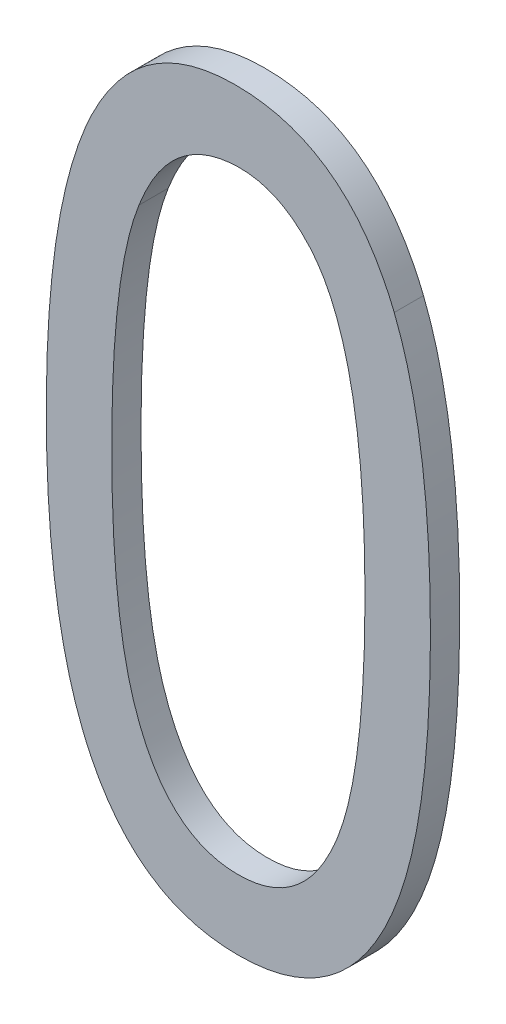
ISO-10303-21;
HEADER;
FILE_DESCRIPTION(('STEP AP214'),'2;1');
FILE_NAME('part.step','',(''),(''),'','','');
FILE_SCHEMA(('AUTOMOTIVE_DESIGN { 1 0 10303 214 1 1 1 1 }'));
ENDSEC;
DATA;
#1=APPLICATION_CONTEXT('core data for automotive mechanical design processes');
#2=APPLICATION_PROTOCOL_DEFINITION('international standard','automotive_design',2000,#1);
#3=PRODUCT_CONTEXT('',#1,'mechanical');
#4=PRODUCT('Part','Part','',(#3));
#5=PRODUCT_RELATED_PRODUCT_CATEGORY('part','',(#4));
#6=PRODUCT_DEFINITION_FORMATION('','',#4);
#7=PRODUCT_DEFINITION_CONTEXT('part definition',#1,'design');
#8=PRODUCT_DEFINITION('design','',#6,#7);
#9=PRODUCT_DEFINITION_SHAPE('','',#8);
#10=(LENGTH_UNIT() NAMED_UNIT(*) SI_UNIT(.MILLI.,.METRE.));
#11=(NAMED_UNIT(*) PLANE_ANGLE_UNIT() SI_UNIT($,.RADIAN.));
#12=(NAMED_UNIT(*) SI_UNIT($,.STERADIAN.) SOLID_ANGLE_UNIT());
#13=UNCERTAINTY_MEASURE_WITH_UNIT(LENGTH_MEASURE(1.E-05),#10,'distance_accuracy_value','');
#14=(GEOMETRIC_REPRESENTATION_CONTEXT(3) GLOBAL_UNCERTAINTY_ASSIGNED_CONTEXT((#13)) GLOBAL_UNIT_ASSIGNED_CONTEXT((#10,
#11,#12)) REPRESENTATION_CONTEXT('',''));
#15=CARTESIAN_POINT('',(0.,0.,0.));
#16=DIRECTION('',(0.,0.,1.));
#17=DIRECTION('',(1.,0.,0.));
#18=AXIS2_PLACEMENT_3D('',#15,#16,#17);
#19=CARTESIAN_POINT('',(166.747554665936,127.21231620352,-39.));
#20=DIRECTION('',(0.,0.,-1.));
#21=DIRECTION('',(-1.,0.,0.));
#22=AXIS2_PLACEMENT_3D('',#19,#20,#21);
#23=PLANE('',#22);
#24=CARTESIAN_POINT('',(166.853987644932,126.928948416499,-39.));
#25=CARTESIAN_POINT('',(166.847814878892,126.9132536326,-39.));
#26=CARTESIAN_POINT('',(166.84221538166,126.897351026162,-39.));
#27=CARTESIAN_POINT('',(166.831968031697,126.865261709913,-39.));
#28=CARTESIAN_POINT('',(166.827318998028,126.849075380124,-39.));
#29=CARTESIAN_POINT('',(166.814530243621,126.800398594227,-39.));
#30=CARTESIAN_POINT('',(166.807488482466,126.767623621181,-39.));
#31=CARTESIAN_POINT('',(166.795445926564,126.701804748235,-39.));
#32=CARTESIAN_POINT('',(166.79044024456,126.668761688815,-39.));
#33=CARTESIAN_POINT('',(166.781914374771,126.602483406797,-39.));
#34=CARTESIAN_POINT('',(166.778394422721,126.569248154551,-39.));
#35=CARTESIAN_POINT('',(166.77248473704,126.502527179504,-39.));
#36=CARTESIAN_POINT('',(166.77010027084,126.469041007509,-39.));
#37=CARTESIAN_POINT('',(166.766249983077,126.402020945451,-39.));
#38=CARTESIAN_POINT('',(166.764784069523,126.368487060503,-39.));
#39=CARTESIAN_POINT('',(166.761985691489,126.282333840904,-39.));
#40=CARTESIAN_POINT('',(166.761202394598,126.229697348206,-39.));
#41=CARTESIAN_POINT('',(166.761002877374,126.124407380513,-39.));
#42=CARTESIAN_POINT('',(166.76158707745,126.071753905272,-39.));
#43=CARTESIAN_POINT('',(166.764474046605,125.966678071929,-39.));
#44=CARTESIAN_POINT('',(166.766770635641,125.914255562963,-39.));
#45=CARTESIAN_POINT('',(166.773707927429,125.809581309508,-39.));
#46=CARTESIAN_POINT('',(166.778347255698,125.75732948295,-39.));
#47=CARTESIAN_POINT('',(166.789044230652,125.670096848503,-39.));
#48=CARTESIAN_POINT('',(166.794155220586,125.635005806206,-39.));
#49=CARTESIAN_POINT('',(166.803529058764,125.582601834785,-39.));
#50=CARTESIAN_POINT('',(166.806946663373,125.565138416613,-39.));
#51=CARTESIAN_POINT('',(166.814482109437,125.530363641215,-39.));
#52=CARTESIAN_POINT('',(166.818599822044,125.513052256623,-39.));
#53=CARTESIAN_POINT('',(166.825981524059,125.485179486085,-39.));
#54=CARTESIAN_POINT('',(166.828977264472,125.474547424449,-39.));
#55=CARTESIAN_POINT('',(166.835369162163,125.453407013795,-39.));
#56=CARTESIAN_POINT('',(166.838765253605,125.442898644748,-39.));
#57=CARTESIAN_POINT('',(166.849486378761,125.411529648947,-39.));
#58=CARTESIAN_POINT('',(166.85733910185,125.390844351044,-39.));
#59=CARTESIAN_POINT('',(166.874764494375,125.350333566176,-39.));
#60=CARTESIAN_POINT('',(166.884327456152,125.330503972339,-39.));
#61=CARTESIAN_POINT('',(166.905591331492,125.292032067889,-39.));
#62=CARTESIAN_POINT('',(166.917288994235,125.273388009324,-39.));
#63=CARTESIAN_POINT('',(166.941170289406,125.240815954733,-39.));
#64=CARTESIAN_POINT('',(166.95297192051,125.226612110534,-39.));
#65=CARTESIAN_POINT('',(166.978558605853,125.200122518192,-39.));
#66=CARTESIAN_POINT('',(166.99234049841,125.187833776388,-39.));
#67=CARTESIAN_POINT('',(167.022017247193,125.165732391389,-39.));
#68=CARTESIAN_POINT('',(167.037932510843,125.155946714029,-39.));
#69=CARTESIAN_POINT('',(167.071347495604,125.139609832535,-39.));
#70=CARTESIAN_POINT('',(167.088846710421,125.133057599154,-39.));
#71=CARTESIAN_POINT('',(167.122842872521,125.123852414056,-39.));
#72=CARTESIAN_POINT('',(167.139250883468,125.120861105097,-39.));
#73=CARTESIAN_POINT('',(167.172350294251,125.117318580688,-39.));
#74=CARTESIAN_POINT('',(167.18904230906,125.116773594918,-39.));
#75=CARTESIAN_POINT('',(167.224577997575,125.118003531979,-39.));
#76=CARTESIAN_POINT('',(167.243413015985,125.120096169284,-39.));
#77=CARTESIAN_POINT('',(167.280348195018,125.127690302764,-39.));
#78=CARTESIAN_POINT('',(167.298450660649,125.133180047794,-39.));
#79=CARTESIAN_POINT('',(167.332291451205,125.147167435494,-39.));
#80=CARTESIAN_POINT('',(167.34810497003,125.155483745995,-39.));
#81=CARTESIAN_POINT('',(167.378033398099,125.174769768659,-39.));
#82=CARTESIAN_POINT('',(167.392145682045,125.185743505126,-39.));
#83=CARTESIAN_POINT('',(167.422420626719,125.213297000385,-39.));
#84=CARTESIAN_POINT('',(167.437942208866,125.230573008783,-39.));
#85=CARTESIAN_POINT('',(167.466131814948,125.267355855729,-39.));
#86=CARTESIAN_POINT('',(167.478787817926,125.286871592627,-39.));
#87=CARTESIAN_POINT('',(167.498658309246,125.321875723024,-39.));
#88=CARTESIAN_POINT('',(167.506425874882,125.337060091012,-39.));
#89=CARTESIAN_POINT('',(167.520780695096,125.367792273056,-39.));
#90=CARTESIAN_POINT('',(167.527379137551,125.383334828578,-39.));
#91=CARTESIAN_POINT('',(167.533528222996,125.399038411206,-39.));
#92=B_SPLINE_CURVE_WITH_KNOTS('',3,(#24,#25,#26,#27,#28,#29,#30,#31,#32,#33,#34,#35,#36,#37,#38,
#39,#40,#41,#42,#43,#44,#45,#46,#47,#48,#49,#50,#51,#52,#53,#54,#55,#56,#57,#58,#59,#60,#61,#62,
#63,#64,#65,#66,#67,#68,#69,#70,#71,#72,#73,#74,#75,#76,#77,#78,#79,#80,#81,#82,#83,#84,#85,#86,
#87,#88,#89,#90,#91),.UNSPECIFIED.,.F.,.F.,(4,2,2,2,2,2,2,2,2,2,2,2,2,2,2,2,2,2,2,2,2,2,2,2,2,2,
2,2,2,2,2,2,2,4),(0.,0.0505598864734835,0.101056565921413,0.201520398804515,0.301741641931057,
0.401978780703016,0.502676488224815,0.603364109413422,0.761266343733771,0.919217128385346,
1.0766006083856,1.23389185877171,1.34021706621926,1.3935905096438,1.44695414085818,
1.48008500979755,1.51321043823833,1.57952088188217,1.64546623600345,1.71131199109594,
1.76654814266601,1.82169706452563,1.87741721830826,1.93311962417899,1.98294739535756,
2.03290198362833,2.08949093296397,2.14588521783889,2.19918888570155,2.25257378499938,
2.32185784254182,2.39142736966029,2.44255239605439,2.49315810580363),.UNSPECIFIED.);
#93=CARTESIAN_POINT('',(166.853987644932,126.928948416499,-39.));
#94=VERTEX_POINT('',#93);
#95=CARTESIAN_POINT('',(167.533528222996,125.399038411206,-39.));
#96=VERTEX_POINT('',#95);
#97=EDGE_CURVE('E82',#94,#96,#92,.T.);
#98=ORIENTED_EDGE('',*,*,#97,.F.);
#99=CARTESIAN_POINT('',(167.533528222996,125.399038411206,-39.));
#100=CARTESIAN_POINT('',(167.539652857504,125.414739762002,-39.));
#101=CARTESIAN_POINT('',(167.54521594489,125.430643427273,-39.));
#102=CARTESIAN_POINT('',(167.555407393992,125.462728729021,-39.));
#103=CARTESIAN_POINT('',(167.560036865658,125.478910010305,-39.));
#104=CARTESIAN_POINT('',(167.572787752058,125.527590671538,-39.));
#105=CARTESIAN_POINT('',(167.579823436927,125.560370708689,-39.));
#106=CARTESIAN_POINT('',(167.591870089194,125.626206099966,-39.));
#107=CARTESIAN_POINT('',(167.59688540706,125.659260704397,-39.));
#108=CARTESIAN_POINT('',(167.605431383721,125.725561759351,-39.));
#109=CARTESIAN_POINT('',(167.608961799437,125.758808240382,-39.));
#110=CARTESIAN_POINT('',(167.617881739406,125.858936864082,-39.));
#111=CARTESIAN_POINT('',(167.621562238437,125.925969366923,-39.));
#112=CARTESIAN_POINT('',(167.624851602611,126.026437311402,-39.));
#113=CARTESIAN_POINT('',(167.625576879672,126.059850293964,-39.));
#114=CARTESIAN_POINT('',(167.626416792393,126.126685847795,-39.));
#115=CARTESIAN_POINT('',(167.626531403129,126.1601084194,-39.));
#116=CARTESIAN_POINT('',(167.625953360654,126.260161050749,-39.));
#117=CARTESIAN_POINT('',(167.624345549883,126.326792772413,-39.));
#118=CARTESIAN_POINT('',(167.618249297178,126.447777795608,-39.));
#119=CARTESIAN_POINT('',(167.614338206548,126.502159284629,-39.));
#120=CARTESIAN_POINT('',(167.603268627063,126.610987434158,-39.));
#121=CARTESIAN_POINT('',(167.59608922174,126.665432225956,-39.));
#122=CARTESIAN_POINT('',(167.58155827073,126.746880825657,-39.));
#123=CARTESIAN_POINT('',(167.57602929839,126.774206456516,-39.));
#124=CARTESIAN_POINT('',(167.563333594845,126.828468998898,-39.));
#125=CARTESIAN_POINT('',(167.556167897711,126.855406144487,-39.));
#126=CARTESIAN_POINT('',(167.539765314517,126.908348600257,-39.));
#127=CARTESIAN_POINT('',(167.53055054359,126.93436065426,-39.));
#128=CARTESIAN_POINT('',(167.509260903943,126.985178523736,-39.));
#129=CARTESIAN_POINT('',(167.497194384741,127.009987610473,-39.));
#130=CARTESIAN_POINT('',(167.478198977464,127.041954304918,-39.));
#131=CARTESIAN_POINT('',(167.473000010237,127.050143229378,-39.));
#132=CARTESIAN_POINT('',(167.46205534839,127.066148485094,-39.));
#133=CARTESIAN_POINT('',(167.456309851391,127.073964949506,-39.));
#134=CARTESIAN_POINT('',(167.444181377829,127.089113301841,-39.));
#135=CARTESIAN_POINT('',(167.437797019784,127.096444080067,-39.));
#136=CARTESIAN_POINT('',(167.424571932398,127.110686147085,-39.));
#137=CARTESIAN_POINT('',(167.417730942815,127.117597192304,-39.));
#138=CARTESIAN_POINT('',(167.403512166729,127.130944059741,-39.));
#139=CARTESIAN_POINT('',(167.396131236433,127.137376571875,-39.));
#140=CARTESIAN_POINT('',(167.380877250051,127.149617759199,-39.));
#141=CARTESIAN_POINT('',(167.373004415021,127.155426711464,-39.));
#142=CARTESIAN_POINT('',(167.348694951818,127.171731729472,-39.));
#143=CARTESIAN_POINT('',(167.331511080565,127.181160385396,-39.));
#144=CARTESIAN_POINT('',(167.296246926744,127.196074883058,-39.));
#145=CARTESIAN_POINT('',(167.278224073462,127.201694800711,-39.));
#146=CARTESIAN_POINT('',(167.250629970765,127.207389916442,-39.));
#147=CARTESIAN_POINT('',(167.241321380854,127.208832612515,-39.));
#148=CARTESIAN_POINT('',(167.22260413739,127.210811705159,-39.));
#149=CARTESIAN_POINT('',(167.213195456997,127.21134785214,-39.));
#150=CARTESIAN_POINT('',(167.195654072967,127.21159469605,-39.));
#151=CARTESIAN_POINT('',(167.18752208102,127.211407854803,-39.));
#152=CARTESIAN_POINT('',(167.171288293235,127.210525157236,-39.));
#153=CARTESIAN_POINT('',(167.163186492869,127.209829380619,-39.));
#154=CARTESIAN_POINT('',(167.138999856538,127.206877594109,-39.));
#155=CARTESIAN_POINT('',(167.123008729064,127.203757649748,-39.));
#156=CARTESIAN_POINT('',(167.088639786759,127.19418365331,-39.));
#157=CARTESIAN_POINT('',(167.070406309458,127.187197164989,-39.));
#158=CARTESIAN_POINT('',(167.035668826631,127.169825519232,-39.));
#159=CARTESIAN_POINT('',(167.019163172682,127.159443640891,-39.));
#160=CARTESIAN_POINT('',(166.987049468743,127.134952458311,-39.));
#161=CARTESIAN_POINT('',(166.971622032669,127.120609569158,-39.));
#162=CARTESIAN_POINT('',(166.943228861218,127.089554214469,-39.));
#163=CARTESIAN_POINT('',(166.930278870607,127.07282770049,-39.));
#164=CARTESIAN_POINT('',(166.905081871774,127.035557881647,-39.));
#165=CARTESIAN_POINT('',(166.893156801767,127.01480272305,-39.));
#166=CARTESIAN_POINT('',(166.87187280757,126.97241978189,-39.));
#167=CARTESIAN_POINT('',(166.862475614134,126.950811460588,-39.));
#168=CARTESIAN_POINT('',(166.853987644932,126.928948416499,-39.));
#169=B_SPLINE_CURVE_WITH_KNOTS('',3,(#99,#100,#101,#102,#103,#104,#105,#106,#107,#108,#109,#110,
#111,#112,#113,#114,#115,#116,#117,#118,#119,#120,#121,#122,#123,#124,#125,#126,#127,#128,#129,
#130,#131,#132,#133,#134,#135,#136,#137,#138,#139,#140,#141,#142,#143,#144,#145,#146,#147,#148,
#149,#150,#151,#152,#153,#154,#155,#156,#157,#158,#159,#160,#161,#162,#163,#164,#165,#166,#167,
#168),.UNSPECIFIED.,.F.,.F.,(4,2,2,2,2,2,2,2,2,2,2,2,2,2,2,2,2,2,2,2,2,2,2,2,2,2,2,2,2,2,2,2,2,
2,4),(0.,0.0505272345243938,0.100994039860519,0.201471045431744,0.301730521681832,
0.402006404171629,0.60328173282032,0.703542383201977,0.803807125552921,1.0036863608285,
1.16719799616346,1.33177110790085,1.41537414136441,1.49892450044938,1.58161347457515,
1.66406328249373,1.69314592018853,1.72221808157955,1.7513545264405,1.78050772084085,
1.80984674962562,1.83917268730295,1.89759272369394,1.95383140319997,1.98205245785205,
2.01028128100677,2.0346661158851,2.05904713274495,2.10773462855982,2.16593738065219,
2.22408408863895,2.28693439901851,2.35017175556575,2.42181005807206,2.49229349340742),.UNSPECIFIED.);
#170=EDGE_CURVE('E80',#96,#94,#169,.T.);
#171=ORIENTED_EDGE('',*,*,#170,.F.);
#172=EDGE_LOOP('',(#98,#171));
#173=FACE_BOUND('',#172,.T.);
#174=CARTESIAN_POINT('',(167.726384464319,127.047397331269,-39.));
#175=CARTESIAN_POINT('',(167.738846780121,127.016239052959,-39.));
#176=CARTESIAN_POINT('',(167.749844297822,126.984553230297,-39.));
#177=CARTESIAN_POINT('',(167.769396920738,126.920532400283,-39.));
#178=CARTESIAN_POINT('',(167.777959204281,126.888199608038,-39.));
#179=CARTESIAN_POINT('',(167.800830997197,126.790485439633,-39.));
#180=CARTESIAN_POINT('',(167.812302040709,126.724453357786,-39.));
#181=CARTESIAN_POINT('',(167.830137443653,126.591590758617,-39.));
#182=CARTESIAN_POINT('',(167.836487591395,126.524758538115,-39.));
#183=CARTESIAN_POINT('',(167.845440074467,126.391124081756,-39.));
#184=CARTESIAN_POINT('',(167.848057318126,126.324322797827,-39.));
#185=CARTESIAN_POINT('',(167.849869442019,126.224164073656,-39.));
#186=CARTESIAN_POINT('',(167.850121998397,126.190818575861,-39.));
#187=CARTESIAN_POINT('',(167.850012703698,126.124128247136,-39.));
#188=CARTESIAN_POINT('',(167.849650853654,126.090783416205,-39.));
#189=CARTESIAN_POINT('',(167.847528364329,125.990835520696,-39.));
#190=CARTESIAN_POINT('',(167.84473218556,125.924249957834,-39.));
#191=CARTESIAN_POINT('',(167.835423208857,125.790979948071,-39.));
#192=CARTESIAN_POINT('',(167.828892325131,125.724296606593,-39.));
#193=CARTESIAN_POINT('',(167.813667488101,125.614477984008,-39.));
#194=CARTESIAN_POINT('',(167.806491368435,125.571136226896,-39.));
#195=CARTESIAN_POINT('',(167.789135335973,125.484991781117,-39.));
#196=CARTESIAN_POINT('',(167.778952910229,125.442189574791,-39.));
#197=CARTESIAN_POINT('',(167.754590642976,125.358090061591,-39.));
#198=CARTESIAN_POINT('',(167.74044408305,125.316783327719,-39.));
#199=CARTESIAN_POINT('',(167.707367809974,125.236169628208,-39.));
#200=CARTESIAN_POINT('',(167.688450435272,125.196857813552,-39.));
#201=CARTESIAN_POINT('',(167.650817073458,125.132691357331,-39.));
#202=CARTESIAN_POINT('',(167.633634376678,125.10695083373,-39.));
#203=CARTESIAN_POINT('',(167.595716992719,125.058191271206,-39.));
#204=CARTESIAN_POINT('',(167.574983940359,125.035170987913,-39.));
#205=CARTESIAN_POINT('',(167.529558334025,124.992782631732,-39.));
#206=CARTESIAN_POINT('',(167.504823017048,124.973459568495,-39.));
#207=CARTESIAN_POINT('',(167.452087761066,124.94000460659,-39.));
#208=CARTESIAN_POINT('',(167.424093077863,124.925864498956,-39.));
#209=CARTESIAN_POINT('',(167.369269272771,124.904553866301,-39.));
#210=CARTESIAN_POINT('',(167.342673413254,124.896770916636,-39.));
#211=CARTESIAN_POINT('',(167.288539674699,124.885416501214,-39.));
#212=CARTESIAN_POINT('',(167.260999374488,124.881856845887,-39.));
#213=CARTESIAN_POINT('',(167.218370053463,124.879213715785,-39.));
#214=CARTESIAN_POINT('',(167.203342411178,124.878828071462,-39.));
#215=CARTESIAN_POINT('',(167.173294519959,124.879051701823,-39.));
#216=CARTESIAN_POINT('',(167.158274271402,124.879661022907,-39.));
#217=CARTESIAN_POINT('',(167.113379661727,124.88315286892,-39.));
#218=CARTESIAN_POINT('',(167.083603422887,124.887694520213,-39.));
#219=CARTESIAN_POINT('',(167.027674201121,124.901266698453,-39.));
#220=CARTESIAN_POINT('',(167.001425043749,124.909895658549,-39.));
#221=CARTESIAN_POINT('',(166.950834880508,124.931519950501,-39.));
#222=CARTESIAN_POINT('',(166.92649028346,124.944506807961,-39.));
#223=CARTESIAN_POINT('',(166.880459680302,124.974383658127,-39.));
#224=CARTESIAN_POINT('',(166.858765251327,124.991260765327,-39.));
#225=CARTESIAN_POINT('',(166.818175750645,125.028261644663,-39.));
#226=CARTESIAN_POINT('',(166.799296048399,125.04840207252,-39.));
#227=CARTESIAN_POINT('',(166.755879183849,125.101439244544,-39.));
#228=CARTESIAN_POINT('',(166.73310446772,125.135750005299,-39.));
#229=CARTESIAN_POINT('',(166.69325471875,125.206979693701,-39.));
#230=CARTESIAN_POINT('',(166.676107363737,125.243857486225,-39.));
#231=CARTESIAN_POINT('',(166.661131403609,125.281251222217,-39.));
#232=B_SPLINE_CURVE_WITH_KNOTS('',3,(#174,#175,#176,#177,#178,#179,#180,#181,#182,#183,#184,
#185,#186,#187,#188,#189,#190,#191,#192,#193,#194,#195,#196,#197,#198,#199,#200,#201,#202,#203,
#204,#205,#206,#207,#208,#209,#210,#211,#212,#213,#214,#215,#216,#217,#218,#219,#220,#221,#222,
#223,#224,#225,#226,#227,#228,#229,#230,#231),.UNSPECIFIED.,.F.,.F.,(4,2,2,2,2,2,2,2,2,2,2,2,2,
2,2,2,2,2,2,2,2,2,2,2,2,2,2,2,4),(0.,0.100558694918904,0.200817826406527,0.401542047706436,
0.602821427213961,0.803294672023343,0.903330108470145,1.00336537691824,1.20322873447954,
1.40406825296401,1.53579185395421,1.66762587495598,1.7983846158743,1.92880859115131,
2.02140063548067,2.11395015836411,2.20756322165527,2.30102736961851,2.3837951870279,
2.46679392288352,2.51186322136486,2.55693462169361,2.64687466350657,2.72938910637864,
2.81174401210941,2.89382996037291,2.97634889005707,3.09931227669096,3.2206270879393),.UNSPECIFIED.);
#233=CARTESIAN_POINT('',(167.726384464319,127.047397331269,-39.));
#234=VERTEX_POINT('',#233);
#235=CARTESIAN_POINT('',(166.661131403609,125.281251222217,-39.));
#236=VERTEX_POINT('',#235);
#237=EDGE_CURVE('E67',#234,#236,#232,.T.);
#238=ORIENTED_EDGE('',*,*,#237,.F.);
#239=CARTESIAN_POINT('',(166.661131403609,125.281251222217,-39.));
#240=CARTESIAN_POINT('',(166.648702852144,125.312438437969,-39.));
#241=CARTESIAN_POINT('',(166.637727777248,125.344151570257,-39.));
#242=CARTESIAN_POINT('',(166.618222376498,125.408186833191,-39.));
#243=CARTESIAN_POINT('',(166.609682254306,125.440505949572,-39.));
#244=CARTESIAN_POINT('',(166.594482987838,125.505605658729,-39.));
#245=CARTESIAN_POINT('',(166.587825913211,125.538386718016,-39.));
#246=CARTESIAN_POINT('',(166.576065765785,125.604230220191,-39.));
#247=CARTESIAN_POINT('',(166.570963014606,125.637292719861,-39.));
#248=CARTESIAN_POINT('',(166.562031076927,125.703715925087,-39.));
#249=CARTESIAN_POINT('',(166.558206886567,125.737077289236,-39.));
#250=CARTESIAN_POINT('',(166.551657717986,125.803902241854,-39.));
#251=CARTESIAN_POINT('',(166.548932642965,125.837365821059,-39.));
#252=CARTESIAN_POINT('',(166.542237382739,125.936709324496,-39.));
#253=CARTESIAN_POINT('',(166.539606810024,126.002680957742,-39.));
#254=CARTESIAN_POINT('',(166.537709138205,126.101675553337,-39.));
#255=CARTESIAN_POINT('',(166.537418118132,126.134687712192,-39.));
#256=CARTESIAN_POINT('',(166.537465468629,126.200719925423,-39.));
#257=CARTESIAN_POINT('',(166.537803983566,126.233739979873,-39.));
#258=CARTESIAN_POINT('',(166.539898455423,126.33257865152,-39.));
#259=CARTESIAN_POINT('',(166.542728752935,126.398379850559,-39.));
#260=CARTESIAN_POINT('',(166.552094585432,126.52971086449,-39.));
#261=CARTESIAN_POINT('',(166.558628363835,126.595240793215,-39.));
#262=CARTESIAN_POINT('',(166.574869862446,126.712240766799,-39.));
#263=CARTESIAN_POINT('',(166.583650671696,126.763835532176,-39.));
#264=CARTESIAN_POINT('',(166.605440705019,126.866292871823,-39.));
#265=CARTESIAN_POINT('',(166.618459729245,126.917153461004,-39.));
#266=CARTESIAN_POINT('',(166.650422645633,127.017784134273,-39.));
#267=CARTESIAN_POINT('',(166.669442846919,127.067530800492,-39.));
#268=CARTESIAN_POINT('',(166.715641143213,127.163108181109,-39.));
#269=CARTESIAN_POINT('',(166.742777101064,127.208957588124,-39.));
#270=CARTESIAN_POINT('',(166.792503429193,127.27309729111,-39.));
#271=CARTESIAN_POINT('',(166.811328009473,127.294280019059,-39.));
#272=CARTESIAN_POINT('',(166.852114525615,127.33335887896,-39.));
#273=CARTESIAN_POINT('',(166.874070817745,127.351260793532,-39.));
#274=CARTESIAN_POINT('',(166.920997184121,127.382968304411,-39.));
#275=CARTESIAN_POINT('',(166.9459860439,127.396746322067,-39.));
#276=CARTESIAN_POINT('',(166.998098602396,127.419488708746,-39.));
#277=CARTESIAN_POINT('',(167.025224571479,127.42844787719,-39.));
#278=CARTESIAN_POINT('',(167.068783729668,127.438826092904,-39.));
#279=CARTESIAN_POINT('',(167.084864860009,127.441831460384,-39.));
#280=CARTESIAN_POINT('',(167.1172398631,127.446389016085,-39.));
#281=CARTESIAN_POINT('',(167.133533814954,127.447940647427,-39.));
#282=CARTESIAN_POINT('',(167.166234103177,127.449709274447,-39.));
#283=CARTESIAN_POINT('',(167.182640627767,127.449922434881,-39.));
#284=CARTESIAN_POINT('',(167.215427387163,127.449196107889,-39.));
#285=CARTESIAN_POINT('',(167.231807621733,127.448256610121,-39.));
#286=CARTESIAN_POINT('',(167.264821759319,127.445045138324,-39.));
#287=CARTESIAN_POINT('',(167.281452906223,127.442743207883,-39.));
#288=CARTESIAN_POINT('',(167.314438695599,127.436680429768,-39.));
#289=CARTESIAN_POINT('',(167.330793403622,127.43291993317,-39.));
#290=CARTESIAN_POINT('',(167.379055806389,127.419338018988,-39.));
#291=CARTESIAN_POINT('',(167.410361639096,127.407199497073,-39.));
#292=CARTESIAN_POINT('',(167.466869208078,127.37827772482,-39.));
#293=CARTESIAN_POINT('',(167.492368462366,127.362069578846,-39.));
#294=CARTESIAN_POINT('',(167.54013235063,127.325361282833,-39.));
#295=CARTESIAN_POINT('',(167.562388667039,127.304850414373,-39.));
#296=CARTESIAN_POINT('',(167.609067189136,127.254507298032,-39.));
#297=CARTESIAN_POINT('',(167.632387586714,127.223665617728,-39.));
#298=CARTESIAN_POINT('',(167.673890348964,127.158771336519,-39.));
#299=CARTESIAN_POINT('',(167.692067897021,127.124715765135,-39.));
#300=CARTESIAN_POINT('',(167.714542052155,127.075747667787,-39.));
#301=CARTESIAN_POINT('',(167.72061691578,127.061626812379,-39.));
#302=CARTESIAN_POINT('',(167.726384464319,127.047397331269,-39.));
#303=B_SPLINE_CURVE_WITH_KNOTS('',3,(#239,#240,#241,#242,#243,#244,#245,#246,#247,#248,#249,
#250,#251,#252,#253,#254,#255,#256,#257,#258,#259,#260,#261,#262,#263,#264,#265,#266,#267,#268,
#269,#270,#271,#272,#273,#274,#275,#276,#277,#278,#279,#280,#281,#282,#283,#284,#285,#286,#287,
#288,#289,#290,#291,#292,#293,#294,#295,#296,#297,#298,#299,#300,#301,#302),.UNSPECIFIED.,.F.,
.F.,(4,2,2,2,2,2,2,2,2,2,2,2,2,2,2,2,2,2,2,2,2,2,2,2,2,2,2,2,2,2,2,4),(0.,0.100610747931705,
0.200810813564854,0.301120584387825,0.40145109714093,0.502169202979184,0.60287843656761,
0.800859480675781,0.899896603985435,0.998956441696252,1.19646422326949,1.39387840405727,
1.55076633803301,1.70801965667087,1.86735912610013,2.02588525484667,2.11060474335827,
2.19517344188341,2.28029566957767,2.36550957918014,2.41452921553109,2.46356762208146,
2.51274647897242,2.5619257770828,2.61222881688778,2.66251975628126,2.7625091297107,
2.852651999395,2.94302214686292,3.05837189556336,3.17382932187072,3.21991944188317),.UNSPECIFIED.);
#304=EDGE_CURVE('E24',#236,#234,#303,.T.);
#305=ORIENTED_EDGE('',*,*,#304,.F.);
#306=EDGE_LOOP('',(#238,#305));
#307=FACE_BOUND('',#306,.T.);
#308=ADVANCED_FACE('F17',(#173,#307),#23,.F.);
#309=CARTESIAN_POINT('',(167.726384464319,127.047397331269,-39.1));
#310=CARTESIAN_POINT('',(167.726384464319,127.047397331269,-39.));
#311=CARTESIAN_POINT('',(167.617839721166,127.315396272508,-39.1));
#312=CARTESIAN_POINT('',(167.617839721166,127.315396272508,-39.));
#313=CARTESIAN_POINT('',(167.436595243064,127.449726606018,-39.1));
#314=CARTESIAN_POINT('',(167.436595243064,127.449726606018,-39.));
#315=CARTESIAN_POINT('',(166.753015790837,127.449726606018,-39.1));
#316=CARTESIAN_POINT('',(166.753015790837,127.449726606018,-39.));
#317=CARTESIAN_POINT('',(166.537440882342,127.021590025817,-39.1));
#318=CARTESIAN_POINT('',(166.537440882342,127.021590025817,-39.));
#319=CARTESIAN_POINT('',(166.537440882342,125.781515912529,-39.1));
#320=CARTESIAN_POINT('',(166.537440882342,125.781515912529,-39.));
#321=CARTESIAN_POINT('',(166.578839342522,125.487047940057,-39.1));
#322=CARTESIAN_POINT('',(166.578839342522,125.487047940057,-39.));
#323=CARTESIAN_POINT('',(166.661131403609,125.281251222217,-39.1));
#324=CARTESIAN_POINT('',(166.661131403609,125.281251222217,-39.));
#325=B_SPLINE_SURFACE_WITH_KNOTS('',3,1,((#309,#310),(#311,#312),(#313,#314),(#315,#316),(#317,
#318),(#319,#320),(#321,#322),(#323,#324)),.UNSPECIFIED.,.F.,.F.,.F.,(4,2,2,4),(2,2),(0.,
0.288697589169666,0.78023260625893,1.),(1.,1.1),.UNSPECIFIED.);
#326=CARTESIAN_POINT('',(166.661131403609,125.281251222217,-39.1));
#327=CARTESIAN_POINT('',(166.648702852144,125.312438437969,-39.1));
#328=CARTESIAN_POINT('',(166.637727777248,125.344151570257,-39.1));
#329=CARTESIAN_POINT('',(166.618222376498,125.408186833191,-39.1));
#330=CARTESIAN_POINT('',(166.609682254306,125.440505949572,-39.1));
#331=CARTESIAN_POINT('',(166.594482987838,125.505605658729,-39.1));
#332=CARTESIAN_POINT('',(166.587825913211,125.538386718016,-39.1));
#333=CARTESIAN_POINT('',(166.576065765785,125.604230220191,-39.1));
#334=CARTESIAN_POINT('',(166.570963014606,125.637292719861,-39.1));
#335=CARTESIAN_POINT('',(166.562031076927,125.703715925087,-39.1));
#336=CARTESIAN_POINT('',(166.558206886567,125.737077289236,-39.1));
#337=CARTESIAN_POINT('',(166.551657717986,125.803902241854,-39.1));
#338=CARTESIAN_POINT('',(166.548932642965,125.837365821059,-39.1));
#339=CARTESIAN_POINT('',(166.542237382739,125.936709324496,-39.1));
#340=CARTESIAN_POINT('',(166.539606810024,126.002680957742,-39.1));
#341=CARTESIAN_POINT('',(166.537709138205,126.101675553337,-39.1));
#342=CARTESIAN_POINT('',(166.537418118132,126.134687712192,-39.1));
#343=CARTESIAN_POINT('',(166.537465468629,126.200719925423,-39.1));
#344=CARTESIAN_POINT('',(166.537803983566,126.233739979873,-39.1));
#345=CARTESIAN_POINT('',(166.539898455423,126.33257865152,-39.1));
#346=CARTESIAN_POINT('',(166.542728752935,126.398379850559,-39.1));
#347=CARTESIAN_POINT('',(166.552094585433,126.52971086449,-39.1));
#348=CARTESIAN_POINT('',(166.558628363835,126.595240793215,-39.1));
#349=CARTESIAN_POINT('',(166.574869862446,126.712240766799,-39.1));
#350=CARTESIAN_POINT('',(166.583650671696,126.763835532176,-39.1));
#351=CARTESIAN_POINT('',(166.605440705019,126.866292871823,-39.1));
#352=CARTESIAN_POINT('',(166.618459729245,126.917153461004,-39.1));
#353=CARTESIAN_POINT('',(166.650422645633,127.017784134273,-39.1));
#354=CARTESIAN_POINT('',(166.669442846919,127.067530800492,-39.1));
#355=CARTESIAN_POINT('',(166.715641143213,127.163108181109,-39.1));
#356=CARTESIAN_POINT('',(166.742777101064,127.208957588124,-39.1));
#357=CARTESIAN_POINT('',(166.792503429193,127.273097291111,-39.1));
#358=CARTESIAN_POINT('',(166.811328009473,127.29428001906,-39.1));
#359=CARTESIAN_POINT('',(166.852114525615,127.33335887896,-39.1));
#360=CARTESIAN_POINT('',(166.874070817745,127.351260793532,-39.1));
#361=CARTESIAN_POINT('',(166.920997184121,127.382968304411,-39.1));
#362=CARTESIAN_POINT('',(166.9459860439,127.396746322067,-39.1));
#363=CARTESIAN_POINT('',(166.998098602397,127.419488708746,-39.1));
#364=CARTESIAN_POINT('',(167.025224571479,127.42844787719,-39.1));
#365=CARTESIAN_POINT('',(167.068783729668,127.438826092904,-39.1));
#366=CARTESIAN_POINT('',(167.084864860009,127.441831460384,-39.1));
#367=CARTESIAN_POINT('',(167.1172398631,127.446389016085,-39.1));
#368=CARTESIAN_POINT('',(167.133533814954,127.447940647427,-39.1));
#369=CARTESIAN_POINT('',(167.166234103177,127.449709274447,-39.1));
#370=CARTESIAN_POINT('',(167.182640627767,127.449922434881,-39.1));
#371=CARTESIAN_POINT('',(167.215427387164,127.449196107889,-39.1));
#372=CARTESIAN_POINT('',(167.231807621733,127.448256610122,-39.1));
#373=CARTESIAN_POINT('',(167.264821759319,127.445045138324,-39.1));
#374=CARTESIAN_POINT('',(167.281452906223,127.442743207883,-39.1));
#375=CARTESIAN_POINT('',(167.3144386956,127.436680429768,-39.1));
#376=CARTESIAN_POINT('',(167.330793403622,127.43291993317,-39.1));
#377=CARTESIAN_POINT('',(167.37905580639,127.419338018988,-39.1));
#378=CARTESIAN_POINT('',(167.410361639096,127.407199497073,-39.1));
#379=CARTESIAN_POINT('',(167.466869208078,127.37827772482,-39.1));
#380=CARTESIAN_POINT('',(167.492368462366,127.362069578846,-39.1));
#381=CARTESIAN_POINT('',(167.54013235063,127.325361282833,-39.1));
#382=CARTESIAN_POINT('',(167.56238866704,127.304850414373,-39.1));
#383=CARTESIAN_POINT('',(167.609067189136,127.254507298032,-39.1));
#384=CARTESIAN_POINT('',(167.632387586715,127.223665617727,-39.1));
#385=CARTESIAN_POINT('',(167.673890348964,127.158771336519,-39.1));
#386=CARTESIAN_POINT('',(167.692067897022,127.124715765135,-39.1));
#387=CARTESIAN_POINT('',(167.714542052156,127.075747667786,-39.1));
#388=CARTESIAN_POINT('',(167.72061691578,127.061626812379,-39.1));
#389=CARTESIAN_POINT('',(167.726384464319,127.047397331269,-39.1));
#390=B_SPLINE_CURVE_WITH_KNOTS('',3,(#326,#327,#328,#329,#330,#331,#332,#333,#334,#335,#336,
#337,#338,#339,#340,#341,#342,#343,#344,#345,#346,#347,#348,#349,#350,#351,#352,#353,#354,#355,
#356,#357,#358,#359,#360,#361,#362,#363,#364,#365,#366,#367,#368,#369,#370,#371,#372,#373,#374,
#375,#376,#377,#378,#379,#380,#381,#382,#383,#384,#385,#386,#387,#388,#389),.UNSPECIFIED.,.F.,
.F.,(4,2,2,2,2,2,2,2,2,2,2,2,2,2,2,2,2,2,2,2,2,2,2,2,2,2,2,2,2,2,2,4),(0.,0.100610747931705,
0.200810813564854,0.301120584387825,0.40145109714093,0.502169202979208,0.602878436567609,
0.800859480675779,0.899896603985433,0.99895644169625,1.19646422326949,1.39387840405727,
1.55076633803305,1.70801965667098,1.8673591261003,2.02588525484691,2.11060474335843,
2.19517344188357,2.28029566957784,2.36550957918029,2.41452921553124,2.46356762208166,
2.51274647897268,2.56192577708311,2.61222881688807,2.66251975628159,2.76250912971108,
2.85265199939537,2.94302214686329,3.05837189556382,3.17382932187129,3.21991944188315),.UNSPECIFIED.);
#391=CARTESIAN_POINT('',(166.661131403609,125.281251222217,-39.1));
#392=VERTEX_POINT('',#391);
#393=CARTESIAN_POINT('',(167.726384464319,127.047397331269,-39.1));
#394=VERTEX_POINT('',#393);
#395=EDGE_CURVE('E111',#392,#394,#390,.T.);
#396=DIRECTION('',(0.,0.,-1.));
#397=VECTOR('',#396,1.);
#398=CARTESIAN_POINT('',(166.661131403609,125.281251222217,-39.05));
#399=LINE('',#398,#397);
#400=EDGE_CURVE('E71',#236,#392,#399,.T.);
#401=DIRECTION('',(0.,0.,1.));
#402=VECTOR('',#401,1.);
#403=CARTESIAN_POINT('',(167.726384464319,127.047397331269,-39.05));
#404=LINE('',#403,#402);
#405=EDGE_CURVE('E74',#394,#234,#404,.T.);
#406=ORIENTED_EDGE('',*,*,#395,.F.);
#407=ORIENTED_EDGE('',*,*,#400,.F.);
#408=ORIENTED_EDGE('',*,*,#304,.T.);
#409=ORIENTED_EDGE('',*,*,#405,.F.);
#410=EDGE_LOOP('',(#406,#407,#408,#409));
#411=FACE_BOUND('',#410,.T.);
#412=ADVANCED_FACE('F73',(#411),#325,.T.);
#413=CARTESIAN_POINT('',(166.661131403609,125.281251222217,-39.1));
#414=CARTESIAN_POINT('',(166.661131403609,125.281251222217,-39.));
#415=CARTESIAN_POINT('',(166.768785696632,125.012028409316,-39.1));
#416=CARTESIAN_POINT('',(166.768785696632,125.012028409316,-39.));
#417=CARTESIAN_POINT('',(166.947386609971,124.878921947468,-39.1));
#418=CARTESIAN_POINT('',(166.947386609971,124.878921947468,-39.));
#419=CARTESIAN_POINT('',(167.460323628777,124.878921947468,-39.1));
#420=CARTESIAN_POINT('',(167.460323628777,124.878921947468,-39.));
#421=CARTESIAN_POINT('',(167.646616699583,125.036412683307,-39.1));
#422=CARTESIAN_POINT('',(167.646616699583,125.036412683307,-39.));
#423=CARTESIAN_POINT('',(167.817557022721,125.549151100071,-39.1));
#424=CARTESIAN_POINT('',(167.817557022721,125.549151100071,-39.));
#425=CARTESIAN_POINT('',(167.850074985586,125.820557733598,-39.1));
#426=CARTESIAN_POINT('',(167.850074985586,125.820557733598,-39.));
#427=CARTESIAN_POINT('',(167.850074985586,126.549117818299,-39.1));
#428=CARTESIAN_POINT('',(167.850074985586,126.549117818299,-39.));
#429=CARTESIAN_POINT('',(167.808676525407,126.84226233921,-39.1));
#430=CARTESIAN_POINT('',(167.808676525407,126.84226233921,-39.));
#431=CARTESIAN_POINT('',(167.726384464319,127.047397331269,-39.1));
#432=CARTESIAN_POINT('',(167.726384464319,127.047397331269,-39.));
#433=B_SPLINE_SURFACE_WITH_KNOTS('',3,1,((#413,#414),(#415,#416),(#417,#418),(#419,#420),(#421,
#422),(#423,#424),(#425,#426),(#427,#428),(#429,#430),(#431,#432)),.UNSPECIFIED.,.F.,.F.,.F.,(4,
2,2,2,4),(2,2),(0.,0.283935469100288,0.59235818604906,0.785997303847737,1.),(1.,1.1),.UNSPECIFIED.);
#434=CARTESIAN_POINT('',(167.726384464319,127.047397331269,-39.1));
#435=CARTESIAN_POINT('',(167.738846780121,127.016239052959,-39.1));
#436=CARTESIAN_POINT('',(167.749844297822,126.984553230297,-39.1));
#437=CARTESIAN_POINT('',(167.769396920738,126.920532400283,-39.1));
#438=CARTESIAN_POINT('',(167.777959204281,126.888199608038,-39.1));
#439=CARTESIAN_POINT('',(167.800830997197,126.790485439633,-39.1));
#440=CARTESIAN_POINT('',(167.812302040709,126.724453357786,-39.1));
#441=CARTESIAN_POINT('',(167.830137443653,126.591590758617,-39.1));
#442=CARTESIAN_POINT('',(167.836487591395,126.524758538115,-39.1));
#443=CARTESIAN_POINT('',(167.845440074467,126.391124081756,-39.1));
#444=CARTESIAN_POINT('',(167.848057318126,126.324322797827,-39.1));
#445=CARTESIAN_POINT('',(167.849869442019,126.224164073656,-39.1));
#446=CARTESIAN_POINT('',(167.850121998397,126.190818575861,-39.1));
#447=CARTESIAN_POINT('',(167.850012703698,126.124128247136,-39.1));
#448=CARTESIAN_POINT('',(167.849650853654,126.090783416205,-39.1));
#449=CARTESIAN_POINT('',(167.847528364329,125.990835520696,-39.1));
#450=CARTESIAN_POINT('',(167.84473218556,125.924249957834,-39.1));
#451=CARTESIAN_POINT('',(167.835423208857,125.790979948071,-39.1));
#452=CARTESIAN_POINT('',(167.828892325131,125.724296606593,-39.1));
#453=CARTESIAN_POINT('',(167.813667488101,125.614477984008,-39.1));
#454=CARTESIAN_POINT('',(167.806491368435,125.571136226896,-39.1));
#455=CARTESIAN_POINT('',(167.789135335973,125.484991781117,-39.1));
#456=CARTESIAN_POINT('',(167.778952910229,125.442189574791,-39.1));
#457=CARTESIAN_POINT('',(167.754590642976,125.358090061591,-39.1));
#458=CARTESIAN_POINT('',(167.74044408305,125.316783327719,-39.1));
#459=CARTESIAN_POINT('',(167.707367809974,125.236169628208,-39.1));
#460=CARTESIAN_POINT('',(167.688450435272,125.196857813552,-39.1));
#461=CARTESIAN_POINT('',(167.650817073458,125.132691357331,-39.1));
#462=CARTESIAN_POINT('',(167.633634376678,125.10695083373,-39.1));
#463=CARTESIAN_POINT('',(167.595716992719,125.058191271206,-39.1));
#464=CARTESIAN_POINT('',(167.574983940359,125.035170987913,-39.1));
#465=CARTESIAN_POINT('',(167.529558334025,124.992782631732,-39.1));
#466=CARTESIAN_POINT('',(167.504823017048,124.973459568495,-39.1));
#467=CARTESIAN_POINT('',(167.452087761066,124.94000460659,-39.1));
#468=CARTESIAN_POINT('',(167.424093077863,124.925864498956,-39.1));
#469=CARTESIAN_POINT('',(167.369269272771,124.904553866301,-39.1));
#470=CARTESIAN_POINT('',(167.342673413254,124.896770916636,-39.1));
#471=CARTESIAN_POINT('',(167.2885396747,124.885416501214,-39.1));
#472=CARTESIAN_POINT('',(167.260999374488,124.881856845887,-39.1));
#473=CARTESIAN_POINT('',(167.218370053463,124.879213715785,-39.1));
#474=CARTESIAN_POINT('',(167.203342411178,124.878828071462,-39.1));
#475=CARTESIAN_POINT('',(167.173294519959,124.879051701823,-39.1));
#476=CARTESIAN_POINT('',(167.158274271402,124.879661022907,-39.1));
#477=CARTESIAN_POINT('',(167.113379661727,124.883152868919,-39.1));
#478=CARTESIAN_POINT('',(167.083603422887,124.887694520213,-39.1));
#479=CARTESIAN_POINT('',(167.027674201121,124.901266698453,-39.1));
#480=CARTESIAN_POINT('',(167.001425043749,124.909895658549,-39.1));
#481=CARTESIAN_POINT('',(166.950834880508,124.931519950501,-39.1));
#482=CARTESIAN_POINT('',(166.92649028346,124.944506807961,-39.1));
#483=CARTESIAN_POINT('',(166.880459680302,124.974383658127,-39.1));
#484=CARTESIAN_POINT('',(166.858765251327,124.991260765327,-39.1));
#485=CARTESIAN_POINT('',(166.818175750645,125.028261644663,-39.1));
#486=CARTESIAN_POINT('',(166.799296048399,125.04840207252,-39.1));
#487=CARTESIAN_POINT('',(166.755879183849,125.101439244544,-39.1));
#488=CARTESIAN_POINT('',(166.73310446772,125.135750005299,-39.1));
#489=CARTESIAN_POINT('',(166.69325471875,125.206979693701,-39.1));
#490=CARTESIAN_POINT('',(166.676107363737,125.243857486225,-39.1));
#491=CARTESIAN_POINT('',(166.661131403609,125.281251222217,-39.1));
#492=B_SPLINE_CURVE_WITH_KNOTS('',3,(#434,#435,#436,#437,#438,#439,#440,#441,#442,#443,#444,
#445,#446,#447,#448,#449,#450,#451,#452,#453,#454,#455,#456,#457,#458,#459,#460,#461,#462,#463,
#464,#465,#466,#467,#468,#469,#470,#471,#472,#473,#474,#475,#476,#477,#478,#479,#480,#481,#482,
#483,#484,#485,#486,#487,#488,#489,#490,#491),.UNSPECIFIED.,.F.,.F.,(4,2,2,2,2,2,2,2,2,2,2,2,2,
2,2,2,2,2,2,2,2,2,2,2,2,2,2,2,4),(0.,0.100558694918904,0.200817826406527,0.401542047706414,
0.602821427213963,0.803294672023346,0.903330108470148,1.00336537691824,1.20322873447952,
1.40406825296402,1.53579185395421,1.66762587495598,1.79838461587431,1.92880859115131,
2.0214006354807,2.11395015836412,2.20756322165525,2.30102736961844,2.38379518702782,
2.46679392288343,2.51186322136477,2.55693462169355,2.64687466350652,2.72938910637856,
2.81174401210932,2.8938299603728,2.97634889005698,3.09931227669089,3.22062708793929),.UNSPECIFIED.);
#493=EDGE_CURVE('E78',#394,#392,#492,.T.);
#494=ORIENTED_EDGE('',*,*,#493,.F.);
#495=ORIENTED_EDGE('',*,*,#405,.T.);
#496=ORIENTED_EDGE('',*,*,#237,.T.);
#497=ORIENTED_EDGE('',*,*,#400,.T.);
#498=EDGE_LOOP('',(#494,#495,#496,#497));
#499=FACE_BOUND('',#498,.T.);
#500=ADVANCED_FACE('F76',(#499),#433,.T.);
#501=CARTESIAN_POINT('',(166.853987644932,126.928948416499,-39.1));
#502=CARTESIAN_POINT('',(166.853987644932,126.928948416499,-39.));
#503=CARTESIAN_POINT('',(166.926687379881,127.116878538257,-39.1));
#504=CARTESIAN_POINT('',(166.926687379881,127.116878538257,-39.));
#505=CARTESIAN_POINT('',(167.04179529355,127.211505324917,-39.1));
#506=CARTESIAN_POINT('',(167.04179529355,127.211505324917,-39.));
#507=CARTESIAN_POINT('',(167.291195773167,127.211505324917,-39.1));
#508=CARTESIAN_POINT('',(167.291195773167,127.211505324917,-39.));
#509=CARTESIAN_POINT('',(167.371973256443,127.171801778066,-39.1));
#510=CARTESIAN_POINT('',(167.371973256443,127.171801778066,-39.));
#511=CARTESIAN_POINT('',(167.564093667022,126.951463841098,-39.1));
#512=CARTESIAN_POINT('',(167.564093667022,126.951463841098,-39.));
#513=CARTESIAN_POINT('',(167.626422328764,126.641759427616,-39.1));
#514=CARTESIAN_POINT('',(167.626422328764,126.641759427616,-39.));
#515=CARTESIAN_POINT('',(167.626422328764,125.812617024228,-39.1));
#516=CARTESIAN_POINT('',(167.626422328764,125.812617024228,-39.));
#517=CARTESIAN_POINT('',(167.595625913265,125.557852598606,-39.1));
#518=CARTESIAN_POINT('',(167.595625913265,125.557852598606,-39.));
#519=CARTESIAN_POINT('',(167.533528222996,125.399038411206,-39.1));
#520=CARTESIAN_POINT('',(167.533528222996,125.399038411206,-39.));
#521=B_SPLINE_SURFACE_WITH_KNOTS('',3,1,((#501,#502),(#503,#504),(#505,#506),(#507,#508),(#509,
#510),(#511,#512),(#513,#514),(#515,#516),(#517,#518),(#519,#520)),.UNSPECIFIED.,.F.,.F.,.F.,(4,
2,2,2,4),(2,2),(0.,0.295831154739337,0.466902844860165,0.774507987051785,1.),(1.,1.1),.UNSPECIFIED.);
#522=CARTESIAN_POINT('',(167.533528222996,125.399038411206,-39.1));
#523=CARTESIAN_POINT('',(167.539652857504,125.414739762002,-39.1));
#524=CARTESIAN_POINT('',(167.54521594489,125.430643427273,-39.1));
#525=CARTESIAN_POINT('',(167.555407393992,125.462728729021,-39.1));
#526=CARTESIAN_POINT('',(167.560036865658,125.478910010305,-39.1));
#527=CARTESIAN_POINT('',(167.572787752058,125.527590671538,-39.1));
#528=CARTESIAN_POINT('',(167.579823436927,125.560370708689,-39.1));
#529=CARTESIAN_POINT('',(167.591870089194,125.626206099966,-39.1));
#530=CARTESIAN_POINT('',(167.59688540706,125.659260704397,-39.1));
#531=CARTESIAN_POINT('',(167.605431383721,125.725561759351,-39.1));
#532=CARTESIAN_POINT('',(167.608961799437,125.758808240382,-39.1));
#533=CARTESIAN_POINT('',(167.617881739406,125.858936864082,-39.1));
#534=CARTESIAN_POINT('',(167.621562238437,125.925969366923,-39.1));
#535=CARTESIAN_POINT('',(167.624851602611,126.026437311402,-39.1));
#536=CARTESIAN_POINT('',(167.625576879672,126.059850293964,-39.1));
#537=CARTESIAN_POINT('',(167.626416792393,126.126685847795,-39.1));
#538=CARTESIAN_POINT('',(167.626531403129,126.1601084194,-39.1));
#539=CARTESIAN_POINT('',(167.625953360654,126.260161050749,-39.1));
#540=CARTESIAN_POINT('',(167.624345549883,126.326792772413,-39.1));
#541=CARTESIAN_POINT('',(167.618249297178,126.447777795609,-39.1));
#542=CARTESIAN_POINT('',(167.614338206548,126.502159284629,-39.1));
#543=CARTESIAN_POINT('',(167.603268627064,126.610987434158,-39.1));
#544=CARTESIAN_POINT('',(167.59608922174,126.665432225956,-39.1));
#545=CARTESIAN_POINT('',(167.58155827073,126.746880825657,-39.1));
#546=CARTESIAN_POINT('',(167.57602929839,126.774206456516,-39.1));
#547=CARTESIAN_POINT('',(167.563333594845,126.828468998898,-39.1));
#548=CARTESIAN_POINT('',(167.556167897711,126.855406144487,-39.1));
#549=CARTESIAN_POINT('',(167.539765314517,126.908348600257,-39.1));
#550=CARTESIAN_POINT('',(167.53055054359,126.93436065426,-39.1));
#551=CARTESIAN_POINT('',(167.509260903942,126.985178523736,-39.1));
#552=CARTESIAN_POINT('',(167.497194384741,127.009987610473,-39.1));
#553=CARTESIAN_POINT('',(167.478198977464,127.041954304919,-39.1));
#554=CARTESIAN_POINT('',(167.473000010237,127.050143229378,-39.1));
#555=CARTESIAN_POINT('',(167.46205534839,127.066148485094,-39.1));
#556=CARTESIAN_POINT('',(167.456309851391,127.073964949506,-39.1));
#557=CARTESIAN_POINT('',(167.444181377829,127.089113301841,-39.1));
#558=CARTESIAN_POINT('',(167.437797019783,127.096444080067,-39.1));
#559=CARTESIAN_POINT('',(167.424571932397,127.110686147085,-39.1));
#560=CARTESIAN_POINT('',(167.417730942815,127.117597192304,-39.1));
#561=CARTESIAN_POINT('',(167.403512166729,127.130944059741,-39.1));
#562=CARTESIAN_POINT('',(167.396131236433,127.137376571876,-39.1));
#563=CARTESIAN_POINT('',(167.380877250051,127.149617759199,-39.1));
#564=CARTESIAN_POINT('',(167.373004415021,127.155426711465,-39.1));
#565=CARTESIAN_POINT('',(167.348694951817,127.171731729472,-39.1));
#566=CARTESIAN_POINT('',(167.331511080565,127.181160385396,-39.1));
#567=CARTESIAN_POINT('',(167.296246926744,127.196074883058,-39.1));
#568=CARTESIAN_POINT('',(167.278224073462,127.201694800711,-39.1));
#569=CARTESIAN_POINT('',(167.250629970765,127.207389916442,-39.1));
#570=CARTESIAN_POINT('',(167.241321380854,127.208832612515,-39.1));
#571=CARTESIAN_POINT('',(167.22260413739,127.210811705159,-39.1));
#572=CARTESIAN_POINT('',(167.213195456997,127.21134785214,-39.1));
#573=CARTESIAN_POINT('',(167.195654072967,127.21159469605,-39.1));
#574=CARTESIAN_POINT('',(167.18752208102,127.211407854803,-39.1));
#575=CARTESIAN_POINT('',(167.171288293235,127.210525157236,-39.1));
#576=CARTESIAN_POINT('',(167.163186492869,127.209829380619,-39.1));
#577=CARTESIAN_POINT('',(167.138999856538,127.206877594109,-39.1));
#578=CARTESIAN_POINT('',(167.123008729064,127.203757649748,-39.1));
#579=CARTESIAN_POINT('',(167.088639786758,127.19418365331,-39.1));
#580=CARTESIAN_POINT('',(167.070406309458,127.187197164989,-39.1));
#581=CARTESIAN_POINT('',(167.035668826631,127.169825519232,-39.1));
#582=CARTESIAN_POINT('',(167.019163172682,127.159443640891,-39.1));
#583=CARTESIAN_POINT('',(166.987049468743,127.134952458311,-39.1));
#584=CARTESIAN_POINT('',(166.971622032669,127.120609569158,-39.1));
#585=CARTESIAN_POINT('',(166.943228861218,127.089554214469,-39.1));
#586=CARTESIAN_POINT('',(166.930278870607,127.07282770049,-39.1));
#587=CARTESIAN_POINT('',(166.905081871774,127.035557881647,-39.1));
#588=CARTESIAN_POINT('',(166.893156801767,127.01480272305,-39.1));
#589=CARTESIAN_POINT('',(166.87187280757,126.97241978189,-39.1));
#590=CARTESIAN_POINT('',(166.862475614134,126.950811460588,-39.1));
#591=CARTESIAN_POINT('',(166.853987644932,126.928948416499,-39.1));
#592=B_SPLINE_CURVE_WITH_KNOTS('',3,(#522,#523,#524,#525,#526,#527,#528,#529,#530,#531,#532,
#533,#534,#535,#536,#537,#538,#539,#540,#541,#542,#543,#544,#545,#546,#547,#548,#549,#550,#551,
#552,#553,#554,#555,#556,#557,#558,#559,#560,#561,#562,#563,#564,#565,#566,#567,#568,#569,#570,
#571,#572,#573,#574,#575,#576,#577,#578,#579,#580,#581,#582,#583,#584,#585,#586,#587,#588,#589,
#590,#591),.UNSPECIFIED.,.F.,.F.,(4,2,2,2,2,2,2,2,2,2,2,2,2,2,2,2,2,2,2,2,2,2,2,2,2,2,2,2,2,2,2,
2,2,2,4),(0.,0.0505272345243938,0.100994039860519,0.201471045431744,0.301730521681832,
0.402006404171629,0.60328173282032,0.703542383201977,0.803807125552921,1.0036863608285,
1.16719799616352,1.33177110790094,1.41537414136455,1.49892450044956,1.58161347457532,
1.66406328249396,1.69314592018873,1.72221808157972,1.75135452644065,1.78050772084096,
1.80984674962569,1.83917268730304,1.89759272369396,1.95383140320004,1.98205245785218,
2.01028128100687,2.03466611588518,2.05904713274502,2.10773462855988,2.16593738065227,
2.22408408863905,2.28693439901869,2.35017175556604,2.42181005807223,2.49229349340744),.UNSPECIFIED.);
#593=CARTESIAN_POINT('',(167.533528222996,125.399038411206,-39.1));
#594=VERTEX_POINT('',#593);
#595=CARTESIAN_POINT('',(166.853987644932,126.928948416499,-39.1));
#596=VERTEX_POINT('',#595);
#597=EDGE_CURVE('E36',#594,#596,#592,.T.);
#598=DIRECTION('',(0.,0.,-1.));
#599=VECTOR('',#598,1.);
#600=CARTESIAN_POINT('',(167.533528222996,125.399038411206,-39.05));
#601=LINE('',#600,#599);
#602=EDGE_CURVE('E168',#96,#594,#601,.T.);
#603=DIRECTION('',(0.,0.,1.));
#604=VECTOR('',#603,1.);
#605=CARTESIAN_POINT('',(166.853987644932,126.928948416499,-39.05));
#606=LINE('',#605,#604);
#607=EDGE_CURVE('E45',#596,#94,#606,.T.);
#608=ORIENTED_EDGE('',*,*,#597,.F.);
#609=ORIENTED_EDGE('',*,*,#602,.F.);
#610=ORIENTED_EDGE('',*,*,#170,.T.);
#611=ORIENTED_EDGE('',*,*,#607,.F.);
#612=EDGE_LOOP('',(#608,#609,#610,#611));
#613=FACE_BOUND('',#612,.T.);
#614=ADVANCED_FACE('F135',(#613),#521,.T.);
#615=CARTESIAN_POINT('',(167.533528222996,125.399038411206,-39.1));
#616=CARTESIAN_POINT('',(167.533528222996,125.399038411206,-39.));
#617=CARTESIAN_POINT('',(167.460149249935,125.211372462142,-39.1));
#618=CARTESIAN_POINT('',(167.460149249935,125.211372462142,-39.));
#619=CARTESIAN_POINT('',(167.34774001146,125.117143228569,-39.1));
#620=CARTESIAN_POINT('',(167.34774001146,125.117143228569,-39.));
#621=CARTESIAN_POINT('',(167.026144656165,125.117143228569,-39.1));
#622=CARTESIAN_POINT('',(167.026144656165,125.117143228569,-39.));
#623=CARTESIAN_POINT('',(166.907502727603,125.22831315975,-39.1));
#624=CARTESIAN_POINT('',(166.907502727603,125.22831315975,-39.));
#625=CARTESIAN_POINT('',(166.786704334436,125.605615102882,-39.1));
#626=CARTESIAN_POINT('',(166.786704334436,125.605615102882,-39.));
#627=CARTESIAN_POINT('',(166.761093539164,125.844379861708,-39.1));
#628=CARTESIAN_POINT('',(166.761093539164,125.844379861708,-39.));
#629=CARTESIAN_POINT('',(166.761093539164,126.517354980819,-39.1));
#630=CARTESIAN_POINT('',(166.761093539164,126.517354980819,-39.));
#631=CARTESIAN_POINT('',(166.791889954663,126.77145768066,-39.1));
#632=CARTESIAN_POINT('',(166.791889954663,126.77145768066,-39.));
#633=CARTESIAN_POINT('',(166.853987644932,126.928948416499,-39.1));
#634=CARTESIAN_POINT('',(166.853987644932,126.928948416499,-39.));
#635=B_SPLINE_SURFACE_WITH_KNOTS('',3,1,((#615,#616),(#617,#618),(#619,#620),(#621,#622),(#623,
#624),(#625,#626),(#627,#628),(#629,#630),(#631,#632),(#633,#634)),.UNSPECIFIED.,.F.,.F.,.F.,(4,
2,2,2,4),(2,2),(0.,0.27351782579409,0.569381879185741,0.775587409998471,1.),(1.,1.1),.UNSPECIFIED.);
#636=CARTESIAN_POINT('',(166.853987644932,126.928948416499,-39.1));
#637=CARTESIAN_POINT('',(166.847814878892,126.9132536326,-39.1));
#638=CARTESIAN_POINT('',(166.84221538166,126.897351026162,-39.1));
#639=CARTESIAN_POINT('',(166.831968031697,126.865261709913,-39.1));
#640=CARTESIAN_POINT('',(166.827318998028,126.849075380124,-39.1));
#641=CARTESIAN_POINT('',(166.814530243621,126.800398594227,-39.1));
#642=CARTESIAN_POINT('',(166.807488482466,126.767623621181,-39.1));
#643=CARTESIAN_POINT('',(166.795445926564,126.701804748235,-39.1));
#644=CARTESIAN_POINT('',(166.79044024456,126.668761688815,-39.1));
#645=CARTESIAN_POINT('',(166.781914374771,126.602483406797,-39.1));
#646=CARTESIAN_POINT('',(166.778394422721,126.569248154551,-39.1));
#647=CARTESIAN_POINT('',(166.77248473704,126.502527179504,-39.1));
#648=CARTESIAN_POINT('',(166.77010027084,126.469041007509,-39.1));
#649=CARTESIAN_POINT('',(166.766249983077,126.402020945451,-39.1));
#650=CARTESIAN_POINT('',(166.764784069523,126.368487060503,-39.1));
#651=CARTESIAN_POINT('',(166.761985691489,126.282333840904,-39.1));
#652=CARTESIAN_POINT('',(166.761202394598,126.229697348207,-39.1));
#653=CARTESIAN_POINT('',(166.761002877374,126.124407380514,-39.1));
#654=CARTESIAN_POINT('',(166.76158707745,126.071753905273,-39.1));
#655=CARTESIAN_POINT('',(166.764474046605,125.96667807193,-39.1));
#656=CARTESIAN_POINT('',(166.766770635641,125.914255562964,-39.1));
#657=CARTESIAN_POINT('',(166.773707927429,125.80958130951,-39.1));
#658=CARTESIAN_POINT('',(166.778347255698,125.757329482953,-39.1));
#659=CARTESIAN_POINT('',(166.789044230652,125.670096848506,-39.1));
#660=CARTESIAN_POINT('',(166.794155220586,125.635005806208,-39.1));
#661=CARTESIAN_POINT('',(166.803529058764,125.582601834787,-39.1));
#662=CARTESIAN_POINT('',(166.806946663373,125.565138416615,-39.1));
#663=CARTESIAN_POINT('',(166.814482109436,125.530363641215,-39.1));
#664=CARTESIAN_POINT('',(166.818599822044,125.513052256624,-39.1));
#665=CARTESIAN_POINT('',(166.825981524059,125.485179486085,-39.1));
#666=CARTESIAN_POINT('',(166.828977264472,125.47454742445,-39.1));
#667=CARTESIAN_POINT('',(166.835369162162,125.453407013796,-39.1));
#668=CARTESIAN_POINT('',(166.838765253605,125.442898644748,-39.1));
#669=CARTESIAN_POINT('',(166.849486378761,125.411529648948,-39.1));
#670=CARTESIAN_POINT('',(166.85733910185,125.390844351045,-39.1));
#671=CARTESIAN_POINT('',(166.874764494374,125.350333566177,-39.1));
#672=CARTESIAN_POINT('',(166.884327456152,125.33050397234,-39.1));
#673=CARTESIAN_POINT('',(166.905591331491,125.29203206789,-39.1));
#674=CARTESIAN_POINT('',(166.917288994234,125.273388009325,-39.1));
#675=CARTESIAN_POINT('',(166.941170289405,125.240815954734,-39.1));
#676=CARTESIAN_POINT('',(166.952971920509,125.226612110535,-39.1));
#677=CARTESIAN_POINT('',(166.978558605852,125.200122518193,-39.1));
#678=CARTESIAN_POINT('',(166.992340498409,125.187833776389,-39.1));
#679=CARTESIAN_POINT('',(167.022017247192,125.16573239139,-39.1));
#680=CARTESIAN_POINT('',(167.037932510842,125.15594671403,-39.1));
#681=CARTESIAN_POINT('',(167.071347495603,125.139609832536,-39.1));
#682=CARTESIAN_POINT('',(167.08884671042,125.133057599154,-39.1));
#683=CARTESIAN_POINT('',(167.12284287252,125.123852414056,-39.1));
#684=CARTESIAN_POINT('',(167.139250883467,125.120861105097,-39.1));
#685=CARTESIAN_POINT('',(167.17235029425,125.117318580688,-39.1));
#686=CARTESIAN_POINT('',(167.189042309059,125.116773594918,-39.1));
#687=CARTESIAN_POINT('',(167.224577997574,125.118003531979,-39.1));
#688=CARTESIAN_POINT('',(167.243413015984,125.120096169283,-39.1));
#689=CARTESIAN_POINT('',(167.280348195017,125.127690302763,-39.1));
#690=CARTESIAN_POINT('',(167.298450660648,125.133180047793,-39.1));
#691=CARTESIAN_POINT('',(167.332291451204,125.147167435493,-39.1));
#692=CARTESIAN_POINT('',(167.348104970029,125.155483745994,-39.1));
#693=CARTESIAN_POINT('',(167.378033398098,125.174769768659,-39.1));
#694=CARTESIAN_POINT('',(167.392145682044,125.185743505125,-39.1));
#695=CARTESIAN_POINT('',(167.422420626718,125.213297000385,-39.1));
#696=CARTESIAN_POINT('',(167.437942208865,125.230573008782,-39.1));
#697=CARTESIAN_POINT('',(167.466131814948,125.267355855728,-39.1));
#698=CARTESIAN_POINT('',(167.478787817925,125.286871592626,-39.1));
#699=CARTESIAN_POINT('',(167.498658309246,125.321875723023,-39.1));
#700=CARTESIAN_POINT('',(167.506425874882,125.337060091011,-39.1));
#701=CARTESIAN_POINT('',(167.520780695096,125.367792273056,-39.1));
#702=CARTESIAN_POINT('',(167.527379137551,125.383334828578,-39.1));
#703=CARTESIAN_POINT('',(167.533528222996,125.399038411206,-39.1));
#704=B_SPLINE_CURVE_WITH_KNOTS('',3,(#636,#637,#638,#639,#640,#641,#642,#643,#644,#645,#646,
#647,#648,#649,#650,#651,#652,#653,#654,#655,#656,#657,#658,#659,#660,#661,#662,#663,#664,#665,
#666,#667,#668,#669,#670,#671,#672,#673,#674,#675,#676,#677,#678,#679,#680,#681,#682,#683,#684,
#685,#686,#687,#688,#689,#690,#691,#692,#693,#694,#695,#696,#697,#698,#699,#700,#701,#702,#703),
.UNSPECIFIED.,.F.,.F.,(4,2,2,2,2,2,2,2,2,2,2,2,2,2,2,2,2,2,2,2,2,2,2,2,2,2,2,2,2,2,2,2,2,4),(0.,
0.0505598864734835,0.101056565921413,0.201520398804515,0.301741641931034,0.401978780703018,
0.502676488224842,0.603364109413449,0.761266343733105,0.919217128383986,1.07660060838355,
1.23389185876903,1.34021706621767,1.39359050964271,1.44695414085766,1.4800850097969,
1.51321043823754,1.57952088188113,1.64546623600217,1.71131199109443,1.76654814266458,
1.82169706452432,1.87741721830705,1.93311962417785,1.98294739535656,2.03290198362739,
2.0894909329629,2.14588521783772,2.19918888570048,2.25257378499833,2.32185784254055,
2.39142736965876,2.44255239605363,2.49315810580365),.UNSPECIFIED.);
#705=EDGE_CURVE('E11',#596,#594,#704,.T.);
#706=ORIENTED_EDGE('',*,*,#705,.F.);
#707=ORIENTED_EDGE('',*,*,#607,.T.);
#708=ORIENTED_EDGE('',*,*,#97,.T.);
#709=ORIENTED_EDGE('',*,*,#602,.T.);
#710=EDGE_LOOP('',(#706,#707,#708,#709));
#711=FACE_BOUND('',#710,.T.);
#712=ADVANCED_FACE('F19',(#711),#635,.T.);
#713=CARTESIAN_POINT('',(166.747554665936,127.21231620352,-39.1));
#714=DIRECTION('',(0.,0.,-1.));
#715=DIRECTION('',(-1.,0.,0.));
#716=AXIS2_PLACEMENT_3D('',#713,#714,#715);
#717=PLANE('',#716);
#718=ORIENTED_EDGE('',*,*,#597,.T.);
#719=ORIENTED_EDGE('',*,*,#705,.T.);
#720=EDGE_LOOP('',(#718,#719));
#721=FACE_BOUND('',#720,.T.);
#722=ORIENTED_EDGE('',*,*,#395,.T.);
#723=ORIENTED_EDGE('',*,*,#493,.T.);
#724=EDGE_LOOP('',(#722,#723));
#725=FACE_BOUND('',#724,.T.);
#726=ADVANCED_FACE('F97',(#721,#725),#717,.T.);
#727=CLOSED_SHELL('',(#308,#412,#500,#614,#712,#726));
#728=MANIFOLD_SOLID_BREP('B1',#727);
#729=ADVANCED_BREP_SHAPE_REPRESENTATION('',(#18,#728),#14);
#730=SHAPE_DEFINITION_REPRESENTATION(#9,#729);
ENDSEC;
END-ISO-10303-21;
